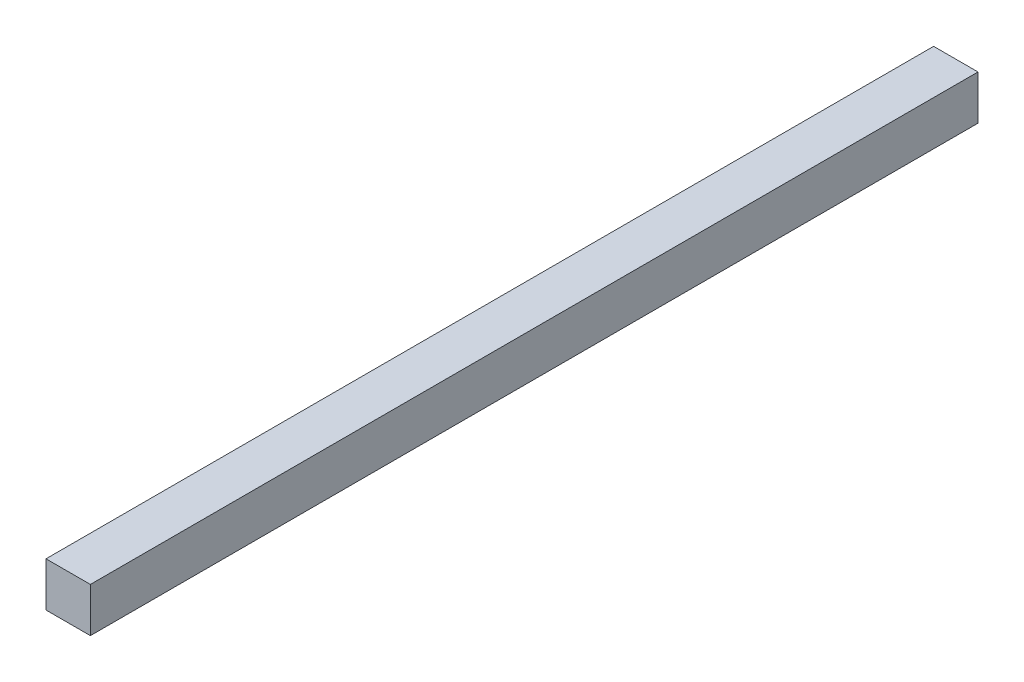
ISO-10303-21;
HEADER;
FILE_DESCRIPTION(('STEP AP214'),'2;1');
FILE_NAME('part.step','',(''),(''),'','','');
FILE_SCHEMA(('AUTOMOTIVE_DESIGN { 1 0 10303 214 1 1 1 1 }'));
ENDSEC;
DATA;
#1=APPLICATION_CONTEXT('core data for automotive mechanical design processes');
#2=APPLICATION_PROTOCOL_DEFINITION('international standard','automotive_design',2000,#1);
#3=PRODUCT_CONTEXT('',#1,'mechanical');
#4=PRODUCT('Part','Part','',(#3));
#5=PRODUCT_RELATED_PRODUCT_CATEGORY('part','',(#4));
#6=PRODUCT_DEFINITION_FORMATION('','',#4);
#7=PRODUCT_DEFINITION_CONTEXT('part definition',#1,'design');
#8=PRODUCT_DEFINITION('design','',#6,#7);
#9=PRODUCT_DEFINITION_SHAPE('','',#8);
#10=(LENGTH_UNIT() NAMED_UNIT(*) SI_UNIT(.MILLI.,.METRE.));
#11=(NAMED_UNIT(*) PLANE_ANGLE_UNIT() SI_UNIT($,.RADIAN.));
#12=(NAMED_UNIT(*) SI_UNIT($,.STERADIAN.) SOLID_ANGLE_UNIT());
#13=UNCERTAINTY_MEASURE_WITH_UNIT(LENGTH_MEASURE(1.E-05),#10,'distance_accuracy_value','');
#14=(GEOMETRIC_REPRESENTATION_CONTEXT(3) GLOBAL_UNCERTAINTY_ASSIGNED_CONTEXT((#13)) GLOBAL_UNIT_ASSIGNED_CONTEXT((#10,
#11,#12)) REPRESENTATION_CONTEXT('',''));
#15=CARTESIAN_POINT('',(0.,0.,0.));
#16=DIRECTION('',(0.,0.,1.));
#17=DIRECTION('',(1.,0.,0.));
#18=AXIS2_PLACEMENT_3D('',#15,#16,#17);
#19=CARTESIAN_POINT('',(-21.840490797546,23.4665855391729,400.));
#20=DIRECTION('',(0.,-1.,0.));
#21=DIRECTION('',(0.,0.,-1.));
#22=AXIS2_PLACEMENT_3D('',#19,#20,#21);
#23=PLANE('',#22);
#24=DIRECTION('',(-1.,0.,0.));
#25=VECTOR('',#24,1.);
#26=CARTESIAN_POINT('',(-21.840490797546,23.4665855391729,0.));
#27=LINE('',#26,#25);
#28=CARTESIAN_POINT('',(-1.84049079754602,23.4665855391729,0.));
#29=VERTEX_POINT('',#28);
#30=CARTESIAN_POINT('',(-21.840490797546,23.4665855391729,0.));
#31=VERTEX_POINT('',#30);
#32=EDGE_CURVE('E98',#29,#31,#27,.T.);
#33=ORIENTED_EDGE('',*,*,#32,.T.);
#34=DIRECTION('',(0.,0.,-1.));
#35=VECTOR('',#34,1.);
#36=CARTESIAN_POINT('',(-21.840490797546,23.4665855391729,400.));
#37=LINE('',#36,#35);
#38=CARTESIAN_POINT('',(-21.840490797546,23.4665855391729,400.));
#39=VERTEX_POINT('',#38);
#40=EDGE_CURVE('E11',#39,#31,#37,.T.);
#41=ORIENTED_EDGE('',*,*,#40,.F.);
#42=DIRECTION('',(-1.,0.,0.));
#43=VECTOR('',#42,1.);
#44=CARTESIAN_POINT('',(-21.840490797546,23.4665855391729,400.));
#45=LINE('',#44,#43);
#46=CARTESIAN_POINT('',(-1.84049079754602,23.4665855391729,400.));
#47=VERTEX_POINT('',#46);
#48=EDGE_CURVE('E86',#47,#39,#45,.T.);
#49=ORIENTED_EDGE('',*,*,#48,.F.);
#50=DIRECTION('',(0.,0.,-1.));
#51=VECTOR('',#50,1.);
#52=CARTESIAN_POINT('',(-1.84049079754602,23.4665855391729,400.));
#53=LINE('',#52,#51);
#54=EDGE_CURVE('E94',#47,#29,#53,.T.);
#55=ORIENTED_EDGE('',*,*,#54,.T.);
#56=EDGE_LOOP('',(#33,#41,#49,#55));
#57=FACE_BOUND('',#56,.T.);
#58=ADVANCED_FACE('F35',(#57),#23,.F.);
#59=CARTESIAN_POINT('',(-21.840490797546,23.4665855391729,400.));
#60=DIRECTION('',(1.,0.,0.));
#61=DIRECTION('',(0.,0.,-1.));
#62=AXIS2_PLACEMENT_3D('',#59,#60,#61);
#63=PLANE('',#62);
#64=DIRECTION('',(0.,-1.,0.));
#65=VECTOR('',#64,1.);
#66=CARTESIAN_POINT('',(-21.840490797546,23.4665855391729,0.));
#67=LINE('',#66,#65);
#68=CARTESIAN_POINT('',(-21.840490797546,3.46658553917293,0.));
#69=VERTEX_POINT('',#68);
#70=EDGE_CURVE('E90',#31,#69,#67,.T.);
#71=ORIENTED_EDGE('',*,*,#70,.T.);
#72=DIRECTION('',(0.,0.,-1.));
#73=VECTOR('',#72,1.);
#74=CARTESIAN_POINT('',(-21.840490797546,3.46658553917293,400.));
#75=LINE('',#74,#73);
#76=CARTESIAN_POINT('',(-21.840490797546,3.46658553917293,400.));
#77=VERTEX_POINT('',#76);
#78=EDGE_CURVE('E43',#77,#69,#75,.T.);
#79=ORIENTED_EDGE('',*,*,#78,.F.);
#80=DIRECTION('',(0.,-1.,0.));
#81=VECTOR('',#80,1.);
#82=CARTESIAN_POINT('',(-21.840490797546,23.4665855391729,400.));
#83=LINE('',#82,#81);
#84=EDGE_CURVE('E81',#39,#77,#83,.T.);
#85=ORIENTED_EDGE('',*,*,#84,.F.);
#86=ORIENTED_EDGE('',*,*,#40,.T.);
#87=EDGE_LOOP('',(#71,#79,#85,#86));
#88=FACE_BOUND('',#87,.T.);
#89=ADVANCED_FACE('F89',(#88),#63,.F.);
#90=CARTESIAN_POINT('',(-1.84049079754602,3.46658553917294,400.));
#91=DIRECTION('',(0.,1.,0.));
#92=DIRECTION('',(-1.,0.,0.));
#93=AXIS2_PLACEMENT_3D('',#90,#91,#92);
#94=PLANE('',#93);
#95=DIRECTION('',(1.,0.,0.));
#96=VECTOR('',#95,1.);
#97=CARTESIAN_POINT('',(-1.84049079754602,3.46658553917294,0.));
#98=LINE('',#97,#96);
#99=CARTESIAN_POINT('',(-1.84049079754602,3.46658553917294,0.));
#100=VERTEX_POINT('',#99);
#101=EDGE_CURVE('E68',#69,#100,#98,.T.);
#102=ORIENTED_EDGE('',*,*,#101,.T.);
#103=DIRECTION('',(0.,0.,-1.));
#104=VECTOR('',#103,1.);
#105=CARTESIAN_POINT('',(-1.84049079754602,3.46658553917294,400.));
#106=LINE('',#105,#104);
#107=CARTESIAN_POINT('',(-1.84049079754602,3.46658553917294,400.));
#108=VERTEX_POINT('',#107);
#109=EDGE_CURVE('E91',#108,#100,#106,.T.);
#110=ORIENTED_EDGE('',*,*,#109,.F.);
#111=DIRECTION('',(1.,0.,0.));
#112=VECTOR('',#111,1.);
#113=CARTESIAN_POINT('',(-1.84049079754602,3.46658553917294,400.));
#114=LINE('',#113,#112);
#115=EDGE_CURVE('E84',#77,#108,#114,.T.);
#116=ORIENTED_EDGE('',*,*,#115,.F.);
#117=ORIENTED_EDGE('',*,*,#78,.T.);
#118=EDGE_LOOP('',(#102,#110,#116,#117));
#119=FACE_BOUND('',#118,.T.);
#120=ADVANCED_FACE('F92',(#119),#94,.F.);
#121=CARTESIAN_POINT('',(-1.84049079754602,23.4665855391729,400.));
#122=DIRECTION('',(-1.,0.,0.));
#123=DIRECTION('',(0.,-1.,0.));
#124=AXIS2_PLACEMENT_3D('',#121,#122,#123);
#125=PLANE('',#124);
#126=DIRECTION('',(0.,1.,0.));
#127=VECTOR('',#126,1.);
#128=CARTESIAN_POINT('',(-1.84049079754602,23.4665855391729,0.));
#129=LINE('',#128,#127);
#130=EDGE_CURVE('E74',#100,#29,#129,.T.);
#131=ORIENTED_EDGE('',*,*,#130,.T.);
#132=ORIENTED_EDGE('',*,*,#54,.F.);
#133=DIRECTION('',(0.,1.,0.));
#134=VECTOR('',#133,1.);
#135=CARTESIAN_POINT('',(-1.84049079754602,23.4665855391729,400.));
#136=LINE('',#135,#134);
#137=EDGE_CURVE('E51',#108,#47,#136,.T.);
#138=ORIENTED_EDGE('',*,*,#137,.F.);
#139=ORIENTED_EDGE('',*,*,#109,.T.);
#140=EDGE_LOOP('',(#131,#132,#138,#139));
#141=FACE_BOUND('',#140,.T.);
#142=ADVANCED_FACE('F105',(#141),#125,.F.);
#143=CARTESIAN_POINT('',(0.,0.,400.));
#144=DIRECTION('',(0.,0.,-1.));
#145=DIRECTION('',(-1.,0.,0.));
#146=AXIS2_PLACEMENT_3D('',#143,#144,#145);
#147=PLANE('',#146);
#148=ORIENTED_EDGE('',*,*,#48,.T.);
#149=ORIENTED_EDGE('',*,*,#84,.T.);
#150=ORIENTED_EDGE('',*,*,#115,.T.);
#151=ORIENTED_EDGE('',*,*,#137,.T.);
#152=EDGE_LOOP('',(#148,#149,#150,#151));
#153=FACE_BOUND('',#152,.T.);
#154=ADVANCED_FACE('F82',(#153),#147,.F.);
#155=CARTESIAN_POINT('',(0.,0.,0.));
#156=DIRECTION('',(0.,0.,-1.));
#157=DIRECTION('',(-1.,0.,0.));
#158=AXIS2_PLACEMENT_3D('',#155,#156,#157);
#159=PLANE('',#158);
#160=ORIENTED_EDGE('',*,*,#32,.F.);
#161=ORIENTED_EDGE('',*,*,#130,.F.);
#162=ORIENTED_EDGE('',*,*,#101,.F.);
#163=ORIENTED_EDGE('',*,*,#70,.F.);
#164=EDGE_LOOP('',(#160,#161,#162,#163));
#165=FACE_BOUND('',#164,.T.);
#166=ADVANCED_FACE('F108',(#165),#159,.T.);
#167=CLOSED_SHELL('',(#58,#89,#120,#142,#154,#166));
#168=MANIFOLD_SOLID_BREP('B2',#167);
#169=ADVANCED_BREP_SHAPE_REPRESENTATION('',(#18,#168),#14);
#170=SHAPE_DEFINITION_REPRESENTATION(#9,#169);
ENDSEC;
END-ISO-10303-21;
